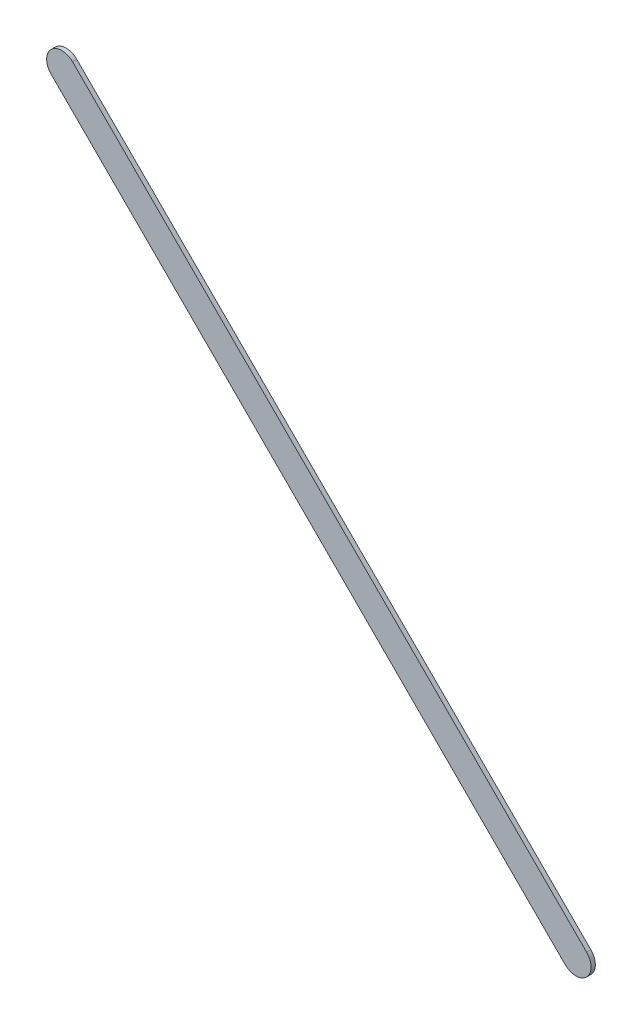
ISO-10303-21;
HEADER;
FILE_DESCRIPTION(('STEP AP214'),'2;1');
FILE_NAME('part.step','',(''),(''),'','','');
FILE_SCHEMA(('AUTOMOTIVE_DESIGN { 1 0 10303 214 1 1 1 1 }'));
ENDSEC;
DATA;
#1=APPLICATION_CONTEXT('core data for automotive mechanical design processes');
#2=APPLICATION_PROTOCOL_DEFINITION('international standard','automotive_design',2000,#1);
#3=PRODUCT_CONTEXT('',#1,'mechanical');
#4=PRODUCT('Part','Part','',(#3));
#5=PRODUCT_RELATED_PRODUCT_CATEGORY('part','',(#4));
#6=PRODUCT_DEFINITION_FORMATION('','',#4);
#7=PRODUCT_DEFINITION_CONTEXT('part definition',#1,'design');
#8=PRODUCT_DEFINITION('design','',#6,#7);
#9=PRODUCT_DEFINITION_SHAPE('','',#8);
#10=(LENGTH_UNIT() NAMED_UNIT(*) SI_UNIT(.MILLI.,.METRE.));
#11=(NAMED_UNIT(*) PLANE_ANGLE_UNIT() SI_UNIT($,.RADIAN.));
#12=(NAMED_UNIT(*) SI_UNIT($,.STERADIAN.) SOLID_ANGLE_UNIT());
#13=UNCERTAINTY_MEASURE_WITH_UNIT(LENGTH_MEASURE(1.E-05),#10,'distance_accuracy_value','');
#14=(GEOMETRIC_REPRESENTATION_CONTEXT(3) GLOBAL_UNCERTAINTY_ASSIGNED_CONTEXT((#13)) GLOBAL_UNIT_ASSIGNED_CONTEXT((#10,
#11,#12)) REPRESENTATION_CONTEXT('',''));
#15=CARTESIAN_POINT('',(0.,0.,0.));
#16=DIRECTION('',(0.,0.,1.));
#17=DIRECTION('',(1.,0.,0.));
#18=AXIS2_PLACEMENT_3D('',#15,#16,#17);
#19=CARTESIAN_POINT('',(77.72716992,54.6971728,0.));
#20=DIRECTION('',(0.707106781186548,0.707106781186548,0.));
#21=DIRECTION('',(0.707106781186548,-0.707106781186548,0.));
#22=AXIS2_PLACEMENT_3D('',#19,#20,#21);
#23=PLANE('',#22);
#24=DIRECTION('',(0.707106781186548,-0.707106781186548,0.));
#25=VECTOR('',#24,1.);
#26=CARTESIAN_POINT('',(77.72716992,54.6971728,0.03556));
#27=LINE('',#26,#25);
#28=CARTESIAN_POINT('',(77.72716992,54.6971728,0.03556));
#29=VERTEX_POINT('',#28);
#30=CARTESIAN_POINT('',(82.02717148,50.39717124,0.03556));
#31=VERTEX_POINT('',#30);
#32=EDGE_CURVE('E11',#29,#31,#27,.T.);
#33=ORIENTED_EDGE('',*,*,#32,.F.);
#34=DIRECTION('',(0.,0.,1.));
#35=VECTOR('',#34,1.);
#36=CARTESIAN_POINT('',(77.72716992,54.6971728,0.));
#37=LINE('',#36,#35);
#38=CARTESIAN_POINT('',(77.72716992,54.6971728,0.));
#39=VERTEX_POINT('',#38);
#40=EDGE_CURVE('E24',#39,#29,#37,.T.);
#41=ORIENTED_EDGE('',*,*,#40,.F.);
#42=DIRECTION('',(0.707106781186548,-0.707106781186548,0.));
#43=VECTOR('',#42,1.);
#44=CARTESIAN_POINT('',(77.72716992,54.6971728,0.));
#45=LINE('',#44,#43);
#46=CARTESIAN_POINT('',(82.02717148,50.39717124,0.));
#47=VERTEX_POINT('',#46);
#48=EDGE_CURVE('E75',#39,#47,#45,.T.);
#49=ORIENTED_EDGE('',*,*,#48,.T.);
#50=DIRECTION('',(0.,0.,1.));
#51=VECTOR('',#50,1.);
#52=CARTESIAN_POINT('',(82.02717148,50.39717124,0.));
#53=LINE('',#52,#51);
#54=EDGE_CURVE('E37',#47,#31,#53,.T.);
#55=ORIENTED_EDGE('',*,*,#54,.T.);
#56=EDGE_LOOP('',(#33,#41,#49,#55));
#57=FACE_BOUND('',#56,.T.);
#58=ADVANCED_FACE('F17',(#57),#23,.F.);
#59=CARTESIAN_POINT('',(82.11697318,50.48697294,0.));
#60=DIRECTION('',(0.,0.,-1.));
#61=DIRECTION('',(-0.707106781186576,-0.70710678118652,0.));
#62=AXIS2_PLACEMENT_3D('',#59,#60,#61);
#63=CYLINDRICAL_SURFACE('',#62,0.126998782064162);
#64=CARTESIAN_POINT('',(82.11697318,50.48697294,0.03556));
#65=DIRECTION('',(0.,0.,1.));
#66=DIRECTION('',(-0.707106781186576,-0.70710678118652,0.));
#67=AXIS2_PLACEMENT_3D('',#64,#65,#66);
#68=CIRCLE('',#67,0.126998782064162);
#69=CARTESIAN_POINT('',(82.20677488,50.57677464,0.03556));
#70=VERTEX_POINT('',#69);
#71=EDGE_CURVE('E83',#31,#70,#68,.T.);
#72=ORIENTED_EDGE('',*,*,#71,.F.);
#73=ORIENTED_EDGE('',*,*,#54,.F.);
#74=CARTESIAN_POINT('',(82.11697318,50.48697294,0.));
#75=DIRECTION('',(0.,0.,1.));
#76=DIRECTION('',(-0.707106781186576,-0.70710678118652,0.));
#77=AXIS2_PLACEMENT_3D('',#74,#75,#76);
#78=CIRCLE('',#77,0.126998782064162);
#79=CARTESIAN_POINT('',(82.20677488,50.57677464,0.));
#80=VERTEX_POINT('',#79);
#81=EDGE_CURVE('E81',#47,#80,#78,.T.);
#82=ORIENTED_EDGE('',*,*,#81,.T.);
#83=DIRECTION('',(0.,0.,1.));
#84=VECTOR('',#83,1.);
#85=CARTESIAN_POINT('',(82.20677488,50.57677464,0.));
#86=LINE('',#85,#84);
#87=EDGE_CURVE('E67',#80,#70,#86,.T.);
#88=ORIENTED_EDGE('',*,*,#87,.T.);
#89=EDGE_LOOP('',(#72,#73,#82,#88));
#90=FACE_BOUND('',#89,.T.);
#91=ADVANCED_FACE('F89',(#90),#63,.T.);
#92=CARTESIAN_POINT('',(82.20677488,50.57677464,0.));
#93=DIRECTION('',(-0.707106781186548,-0.707106781186548,0.));
#94=DIRECTION('',(-0.707106781186548,0.707106781186548,0.));
#95=AXIS2_PLACEMENT_3D('',#92,#93,#94);
#96=PLANE('',#95);
#97=DIRECTION('',(-0.707106781186548,0.707106781186548,0.));
#98=VECTOR('',#97,1.);
#99=CARTESIAN_POINT('',(82.20677488,50.57677464,0.03556));
#100=LINE('',#99,#98);
#101=CARTESIAN_POINT('',(77.90677332,54.8767762,0.03556));
#102=VERTEX_POINT('',#101);
#103=EDGE_CURVE('E71',#70,#102,#100,.T.);
#104=ORIENTED_EDGE('',*,*,#103,.F.);
#105=ORIENTED_EDGE('',*,*,#87,.F.);
#106=DIRECTION('',(-0.707106781186548,0.707106781186548,0.));
#107=VECTOR('',#106,1.);
#108=CARTESIAN_POINT('',(82.20677488,50.57677464,0.));
#109=LINE('',#108,#107);
#110=CARTESIAN_POINT('',(77.90677332,54.8767762,0.));
#111=VERTEX_POINT('',#110);
#112=EDGE_CURVE('E63',#80,#111,#109,.T.);
#113=ORIENTED_EDGE('',*,*,#112,.T.);
#114=DIRECTION('',(0.,0.,1.));
#115=VECTOR('',#114,1.);
#116=CARTESIAN_POINT('',(77.90677332,54.8767762,0.));
#117=LINE('',#116,#115);
#118=EDGE_CURVE('E53',#111,#102,#117,.T.);
#119=ORIENTED_EDGE('',*,*,#118,.T.);
#120=EDGE_LOOP('',(#104,#105,#113,#119));
#121=FACE_BOUND('',#120,.T.);
#122=ADVANCED_FACE('F66',(#121),#96,.F.);
#123=CARTESIAN_POINT('',(77.81697162,54.7869745,0.));
#124=DIRECTION('',(0.,0.,-1.));
#125=DIRECTION('',(0.70710678118652,0.707106781186576,0.));
#126=AXIS2_PLACEMENT_3D('',#123,#124,#125);
#127=CYLINDRICAL_SURFACE('',#126,0.126998782064165);
#128=CARTESIAN_POINT('',(77.81697162,54.7869745,0.03556));
#129=DIRECTION('',(0.,0.,1.));
#130=DIRECTION('',(0.70710678118652,0.707106781186576,0.));
#131=AXIS2_PLACEMENT_3D('',#128,#129,#130);
#132=CIRCLE('',#131,0.126998782064165);
#133=EDGE_CURVE('E59',#102,#29,#132,.T.);
#134=ORIENTED_EDGE('',*,*,#133,.F.);
#135=ORIENTED_EDGE('',*,*,#118,.F.);
#136=CARTESIAN_POINT('',(77.81697162,54.7869745,0.));
#137=DIRECTION('',(0.,0.,1.));
#138=DIRECTION('',(0.70710678118652,0.707106781186576,0.));
#139=AXIS2_PLACEMENT_3D('',#136,#137,#138);
#140=CIRCLE('',#139,0.126998782064165);
#141=EDGE_CURVE('E57',#111,#39,#140,.T.);
#142=ORIENTED_EDGE('',*,*,#141,.T.);
#143=ORIENTED_EDGE('',*,*,#40,.T.);
#144=EDGE_LOOP('',(#134,#135,#142,#143));
#145=FACE_BOUND('',#144,.T.);
#146=ADVANCED_FACE('F55',(#145),#127,.T.);
#147=CARTESIAN_POINT('',(77.72716992,54.6971728,0.));
#148=DIRECTION('',(0.,0.,-1.));
#149=DIRECTION('',(-1.,0.,0.));
#150=AXIS2_PLACEMENT_3D('',#147,#148,#149);
#151=PLANE('',#150);
#152=ORIENTED_EDGE('',*,*,#141,.F.);
#153=ORIENTED_EDGE('',*,*,#112,.F.);
#154=ORIENTED_EDGE('',*,*,#81,.F.);
#155=ORIENTED_EDGE('',*,*,#48,.F.);
#156=EDGE_LOOP('',(#152,#153,#154,#155));
#157=FACE_BOUND('',#156,.T.);
#158=ADVANCED_FACE('F74',(#157),#151,.T.);
#159=CARTESIAN_POINT('',(77.72716992,54.6971728,0.03556));
#160=DIRECTION('',(0.,0.,-1.));
#161=DIRECTION('',(-1.,0.,0.));
#162=AXIS2_PLACEMENT_3D('',#159,#160,#161);
#163=PLANE('',#162);
#164=ORIENTED_EDGE('',*,*,#32,.T.);
#165=ORIENTED_EDGE('',*,*,#71,.T.);
#166=ORIENTED_EDGE('',*,*,#103,.T.);
#167=ORIENTED_EDGE('',*,*,#133,.T.);
#168=EDGE_LOOP('',(#164,#165,#166,#167));
#169=FACE_BOUND('',#168,.T.);
#170=ADVANCED_FACE('F91',(#169),#163,.F.);
#171=CLOSED_SHELL('',(#58,#91,#122,#146,#158,#170));
#172=MANIFOLD_SOLID_BREP('B1',#171);
#173=ADVANCED_BREP_SHAPE_REPRESENTATION('',(#18,#172),#14);
#174=SHAPE_DEFINITION_REPRESENTATION(#9,#173);
ENDSEC;
END-ISO-10303-21;
